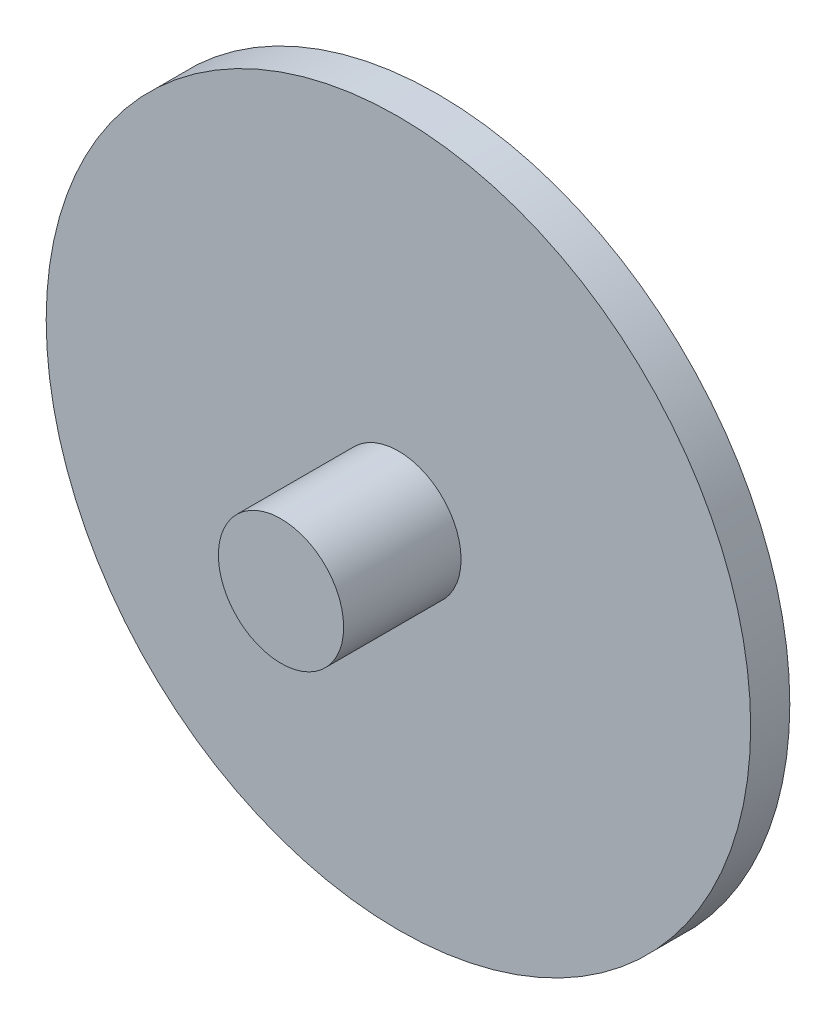
ISO-10303-21;
HEADER;
FILE_DESCRIPTION(('STEP AP214'),'2;1');
FILE_NAME('part.step','',(''),(''),'','','');
FILE_SCHEMA(('AUTOMOTIVE_DESIGN { 1 0 10303 214 1 1 1 1 }'));
ENDSEC;
DATA;
#1=APPLICATION_CONTEXT('core data for automotive mechanical design processes');
#2=APPLICATION_PROTOCOL_DEFINITION('international standard','automotive_design',2000,#1);
#3=PRODUCT_CONTEXT('',#1,'mechanical');
#4=PRODUCT('Part','Part','',(#3));
#5=PRODUCT_RELATED_PRODUCT_CATEGORY('part','',(#4));
#6=PRODUCT_DEFINITION_FORMATION('','',#4);
#7=PRODUCT_DEFINITION_CONTEXT('part definition',#1,'design');
#8=PRODUCT_DEFINITION('design','',#6,#7);
#9=PRODUCT_DEFINITION_SHAPE('','',#8);
#10=(LENGTH_UNIT() NAMED_UNIT(*) SI_UNIT(.MILLI.,.METRE.));
#11=(NAMED_UNIT(*) PLANE_ANGLE_UNIT() SI_UNIT($,.RADIAN.));
#12=(NAMED_UNIT(*) SI_UNIT($,.STERADIAN.) SOLID_ANGLE_UNIT());
#13=UNCERTAINTY_MEASURE_WITH_UNIT(LENGTH_MEASURE(1.E-05),#10,'distance_accuracy_value','');
#14=(GEOMETRIC_REPRESENTATION_CONTEXT(3) GLOBAL_UNCERTAINTY_ASSIGNED_CONTEXT((#13)) GLOBAL_UNIT_ASSIGNED_CONTEXT((#10,
#11,#12)) REPRESENTATION_CONTEXT('',''));
#15=CARTESIAN_POINT('',(0.,0.,0.));
#16=DIRECTION('',(0.,0.,1.));
#17=DIRECTION('',(1.,0.,0.));
#18=AXIS2_PLACEMENT_3D('',#15,#16,#17);
#19=CARTESIAN_POINT('',(0.,0.,-15.));
#20=DIRECTION('',(0.,0.,1.));
#21=DIRECTION('',(1.,0.,0.));
#22=AXIS2_PLACEMENT_3D('',#19,#20,#21);
#23=CYLINDRICAL_SURFACE('',#22,8.);
#24=CARTESIAN_POINT('',(0.,0.,5.));
#25=DIRECTION('',(0.,0.,1.));
#26=DIRECTION('',(1.,0.,0.));
#27=AXIS2_PLACEMENT_3D('',#24,#25,#26);
#28=CIRCLE('',#27,8.);
#29=CARTESIAN_POINT('',(8.,0.,5.));
#30=VERTEX_POINT('',#29);
#31=EDGE_CURVE('E10',#30,#30,#28,.F.);
#32=ORIENTED_EDGE('',*,*,#31,.F.);
#33=EDGE_LOOP('',(#32));
#34=FACE_BOUND('',#33,.T.);
#35=CARTESIAN_POINT('',(0.,0.,20.));
#36=DIRECTION('',(0.,0.,1.));
#37=DIRECTION('',(1.,0.,0.));
#38=AXIS2_PLACEMENT_3D('',#35,#36,#37);
#39=CIRCLE('',#38,8.);
#40=CARTESIAN_POINT('',(8.,0.,20.));
#41=VERTEX_POINT('',#40);
#42=EDGE_CURVE('E51',#41,#41,#39,.T.);
#43=ORIENTED_EDGE('',*,*,#42,.F.);
#44=EDGE_LOOP('',(#43));
#45=FACE_BOUND('',#44,.T.);
#46=ADVANCED_FACE('F39',(#34,#45),#23,.T.);
#47=CARTESIAN_POINT('',(0.,0.,20.));
#48=DIRECTION('',(0.,0.,1.));
#49=DIRECTION('',(1.,0.,0.));
#50=AXIS2_PLACEMENT_3D('',#47,#48,#49);
#51=PLANE('',#50);
#52=ORIENTED_EDGE('',*,*,#42,.T.);
#53=EDGE_LOOP('',(#52));
#54=FACE_BOUND('',#53,.T.);
#55=ADVANCED_FACE('F100',(#54),#51,.T.);
#56=CARTESIAN_POINT('',(0.,0.,5.));
#57=DIRECTION('',(0.,0.,-1.));
#58=DIRECTION('',(-1.,0.,0.));
#59=AXIS2_PLACEMENT_3D('',#56,#57,#58);
#60=CYLINDRICAL_SURFACE('',#59,45.);
#61=CARTESIAN_POINT('',(0.,0.,5.));
#62=DIRECTION('',(0.,0.,1.));
#63=DIRECTION('',(1.,0.,0.));
#64=AXIS2_PLACEMENT_3D('',#61,#62,#63);
#65=CIRCLE('',#64,45.);
#66=CARTESIAN_POINT('',(45.,0.,5.));
#67=VERTEX_POINT('',#66);
#68=EDGE_CURVE('E62',#67,#67,#65,.T.);
#69=ORIENTED_EDGE('',*,*,#68,.F.);
#70=EDGE_LOOP('',(#69));
#71=FACE_BOUND('',#70,.T.);
#72=CARTESIAN_POINT('',(0.,0.,0.));
#73=DIRECTION('',(0.,0.,1.));
#74=DIRECTION('',(1.,0.,0.));
#75=AXIS2_PLACEMENT_3D('',#72,#73,#74);
#76=CIRCLE('',#75,45.);
#77=CARTESIAN_POINT('',(45.,0.,0.));
#78=VERTEX_POINT('',#77);
#79=EDGE_CURVE('E67',#78,#78,#76,.T.);
#80=ORIENTED_EDGE('',*,*,#79,.T.);
#81=EDGE_LOOP('',(#80));
#82=FACE_BOUND('',#81,.T.);
#83=ADVANCED_FACE('F105',(#71,#82),#60,.T.);
#84=CARTESIAN_POINT('',(0.,0.,5.));
#85=DIRECTION('',(0.,0.,1.));
#86=DIRECTION('',(1.,0.,0.));
#87=AXIS2_PLACEMENT_3D('',#84,#85,#86);
#88=PLANE('',#87);
#89=ORIENTED_EDGE('',*,*,#31,.T.);
#90=EDGE_LOOP('',(#89));
#91=FACE_BOUND('',#90,.T.);
#92=ORIENTED_EDGE('',*,*,#68,.T.);
#93=EDGE_LOOP('',(#92));
#94=FACE_BOUND('',#93,.T.);
#95=ADVANCED_FACE('F113',(#91,#94),#88,.T.);
#96=CARTESIAN_POINT('',(0.,0.,0.));
#97=DIRECTION('',(0.,0.,1.));
#98=DIRECTION('',(1.,0.,0.));
#99=AXIS2_PLACEMENT_3D('',#96,#97,#98);
#100=PLANE('',#99);
#101=CARTESIAN_POINT('',(0.,0.,0.));
#102=DIRECTION('',(0.,0.,1.));
#103=DIRECTION('',(1.,0.,0.));
#104=AXIS2_PLACEMENT_3D('',#101,#102,#103);
#105=CIRCLE('',#104,8.);
#106=CARTESIAN_POINT('',(8.,0.,0.));
#107=VERTEX_POINT('',#106);
#108=EDGE_CURVE('E57',#107,#107,#105,.F.);
#109=ORIENTED_EDGE('',*,*,#108,.F.);
#110=EDGE_LOOP('',(#109));
#111=FACE_BOUND('',#110,.T.);
#112=ORIENTED_EDGE('',*,*,#79,.F.);
#113=EDGE_LOOP('',(#112));
#114=FACE_BOUND('',#113,.T.);
#115=ADVANCED_FACE('F118',(#111,#114),#100,.F.);
#116=CARTESIAN_POINT('',(0.,0.,-15.));
#117=DIRECTION('',(0.,0.,1.));
#118=DIRECTION('',(1.,0.,0.));
#119=AXIS2_PLACEMENT_3D('',#116,#117,#118);
#120=PLANE('',#119);
#121=CARTESIAN_POINT('',(0.,0.,-15.));
#122=DIRECTION('',(0.,0.,1.));
#123=DIRECTION('',(1.,0.,0.));
#124=AXIS2_PLACEMENT_3D('',#121,#122,#123);
#125=CIRCLE('',#124,2.);
#126=CARTESIAN_POINT('',(2.,0.,-15.));
#127=VERTEX_POINT('',#126);
#128=EDGE_CURVE('E78',#127,#127,#125,.T.);
#129=ORIENTED_EDGE('',*,*,#128,.T.);
#130=EDGE_LOOP('',(#129));
#131=FACE_BOUND('',#130,.T.);
#132=CARTESIAN_POINT('',(0.,0.,-15.));
#133=DIRECTION('',(0.,0.,1.));
#134=DIRECTION('',(1.,0.,0.));
#135=AXIS2_PLACEMENT_3D('',#132,#133,#134);
#136=CIRCLE('',#135,8.);
#137=CARTESIAN_POINT('',(8.,0.,-15.));
#138=VERTEX_POINT('',#137);
#139=EDGE_CURVE('E46',#138,#138,#136,.T.);
#140=ORIENTED_EDGE('',*,*,#139,.F.);
#141=EDGE_LOOP('',(#140));
#142=FACE_BOUND('',#141,.T.);
#143=ADVANCED_FACE('F83',(#131,#142),#120,.F.);
#144=ORIENTED_EDGE('',*,*,#139,.T.);
#145=EDGE_LOOP('',(#144));
#146=FACE_BOUND('',#145,.T.);
#147=ORIENTED_EDGE('',*,*,#108,.T.);
#148=EDGE_LOOP('',(#147));
#149=FACE_BOUND('',#148,.T.);
#150=ADVANCED_FACE('F89',(#146,#149),#23,.T.);
#151=CARTESIAN_POINT('',(0.,0.,9.99999999999999));
#152=DIRECTION('',(0.,0.,-1.));
#153=DIRECTION('',(-1.,0.,0.));
#154=AXIS2_PLACEMENT_3D('',#151,#152,#153);
#155=CYLINDRICAL_SURFACE('',#154,2.);
#156=CARTESIAN_POINT('',(0.,0.,9.99999999999999));
#157=DIRECTION('',(0.,0.,1.));
#158=DIRECTION('',(1.,0.,0.));
#159=AXIS2_PLACEMENT_3D('',#156,#157,#158);
#160=CIRCLE('',#159,2.);
#161=CARTESIAN_POINT('',(2.,0.,9.99999999999999));
#162=VERTEX_POINT('',#161);
#163=EDGE_CURVE('E73',#162,#162,#160,.T.);
#164=ORIENTED_EDGE('',*,*,#163,.T.);
#165=EDGE_LOOP('',(#164));
#166=FACE_BOUND('',#165,.T.);
#167=ORIENTED_EDGE('',*,*,#128,.F.);
#168=EDGE_LOOP('',(#167));
#169=FACE_BOUND('',#168,.T.);
#170=ADVANCED_FACE('F86',(#166,#169),#155,.F.);
#171=CARTESIAN_POINT('',(0.,0.,9.99999999999999));
#172=DIRECTION('',(0.,0.,1.));
#173=DIRECTION('',(1.,0.,0.));
#174=AXIS2_PLACEMENT_3D('',#171,#172,#173);
#175=PLANE('',#174);
#176=ORIENTED_EDGE('',*,*,#163,.F.);
#177=EDGE_LOOP('',(#176));
#178=FACE_BOUND('',#177,.T.);
#179=ADVANCED_FACE('F88',(#178),#175,.F.);
#180=CLOSED_SHELL('',(#46,#55,#83,#95,#115,#143,#150,#170,#179));
#181=MANIFOLD_SOLID_BREP('B2',#180);
#182=ADVANCED_BREP_SHAPE_REPRESENTATION('',(#18,#181),#14);
#183=SHAPE_DEFINITION_REPRESENTATION(#9,#182);
ENDSEC;
END-ISO-10303-21;
